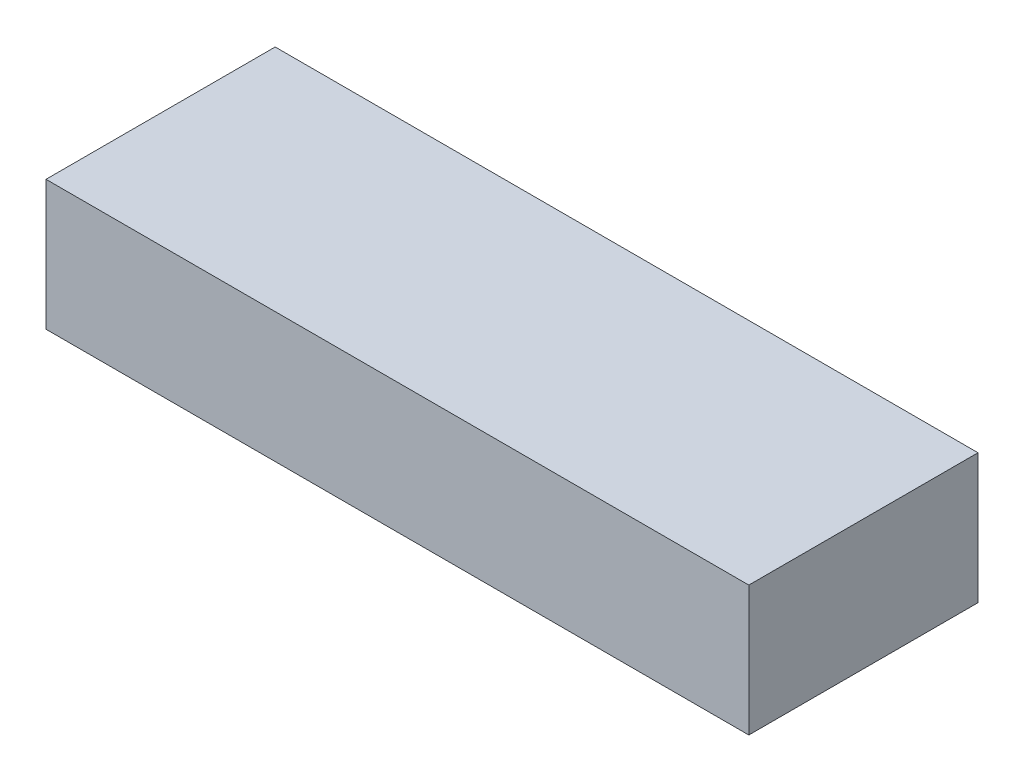
ISO-10303-21;
HEADER;
FILE_DESCRIPTION(('STEP AP214'),'2;1');
FILE_NAME('part.step','',(''),(''),'','','');
FILE_SCHEMA(('AUTOMOTIVE_DESIGN { 1 0 10303 214 1 1 1 1 }'));
ENDSEC;
DATA;
#1=APPLICATION_CONTEXT('core data for automotive mechanical design processes');
#2=APPLICATION_PROTOCOL_DEFINITION('international standard','automotive_design',2000,#1);
#3=PRODUCT_CONTEXT('',#1,'mechanical');
#4=PRODUCT('Part','Part','',(#3));
#5=PRODUCT_RELATED_PRODUCT_CATEGORY('part','',(#4));
#6=PRODUCT_DEFINITION_FORMATION('','',#4);
#7=PRODUCT_DEFINITION_CONTEXT('part definition',#1,'design');
#8=PRODUCT_DEFINITION('design','',#6,#7);
#9=PRODUCT_DEFINITION_SHAPE('','',#8);
#10=(LENGTH_UNIT() NAMED_UNIT(*) SI_UNIT(.MILLI.,.METRE.));
#11=(NAMED_UNIT(*) PLANE_ANGLE_UNIT() SI_UNIT($,.RADIAN.));
#12=(NAMED_UNIT(*) SI_UNIT($,.STERADIAN.) SOLID_ANGLE_UNIT());
#13=UNCERTAINTY_MEASURE_WITH_UNIT(LENGTH_MEASURE(1.E-05),#10,'distance_accuracy_value','');
#14=(GEOMETRIC_REPRESENTATION_CONTEXT(3) GLOBAL_UNCERTAINTY_ASSIGNED_CONTEXT((#13)) GLOBAL_UNIT_ASSIGNED_CONTEXT((#10,
#11,#12)) REPRESENTATION_CONTEXT('',''));
#15=CARTESIAN_POINT('',(0.,0.,0.));
#16=DIRECTION('',(0.,0.,1.));
#17=DIRECTION('',(1.,0.,0.));
#18=AXIS2_PLACEMENT_3D('',#15,#16,#17);
#19=CARTESIAN_POINT('',(23.,8.5,-7.5));
#20=DIRECTION('',(-1.,0.,0.));
#21=DIRECTION('',(0.,0.,1.));
#22=AXIS2_PLACEMENT_3D('',#19,#20,#21);
#23=PLANE('',#22);
#24=DIRECTION('',(0.,0.,-1.));
#25=VECTOR('',#24,1.);
#26=CARTESIAN_POINT('',(23.,0.,-7.5));
#27=LINE('',#26,#25);
#28=CARTESIAN_POINT('',(23.,0.,7.5));
#29=VERTEX_POINT('',#28);
#30=CARTESIAN_POINT('',(23.,0.,-7.5));
#31=VERTEX_POINT('',#30);
#32=EDGE_CURVE('E100',#29,#31,#27,.T.);
#33=ORIENTED_EDGE('',*,*,#32,.T.);
#34=DIRECTION('',(0.,-1.,0.));
#35=VECTOR('',#34,1.);
#36=CARTESIAN_POINT('',(23.,8.5,-7.5));
#37=LINE('',#36,#35);
#38=CARTESIAN_POINT('',(23.,8.5,-7.5));
#39=VERTEX_POINT('',#38);
#40=EDGE_CURVE('E11',#39,#31,#37,.T.);
#41=ORIENTED_EDGE('',*,*,#40,.F.);
#42=DIRECTION('',(0.,0.,-1.));
#43=VECTOR('',#42,1.);
#44=CARTESIAN_POINT('',(23.,8.5,-7.5));
#45=LINE('',#44,#43);
#46=CARTESIAN_POINT('',(23.,8.5,7.5));
#47=VERTEX_POINT('',#46);
#48=EDGE_CURVE('E88',#47,#39,#45,.T.);
#49=ORIENTED_EDGE('',*,*,#48,.F.);
#50=DIRECTION('',(0.,-1.,0.));
#51=VECTOR('',#50,1.);
#52=CARTESIAN_POINT('',(23.,8.5,7.5));
#53=LINE('',#52,#51);
#54=EDGE_CURVE('E96',#47,#29,#53,.T.);
#55=ORIENTED_EDGE('',*,*,#54,.T.);
#56=EDGE_LOOP('',(#33,#41,#49,#55));
#57=FACE_BOUND('',#56,.T.);
#58=ADVANCED_FACE('F37',(#57),#23,.F.);
#59=CARTESIAN_POINT('',(-23.,8.5,-7.5));
#60=DIRECTION('',(0.,0.,1.));
#61=DIRECTION('',(1.,0.,0.));
#62=AXIS2_PLACEMENT_3D('',#59,#60,#61);
#63=PLANE('',#62);
#64=DIRECTION('',(-1.,0.,0.));
#65=VECTOR('',#64,1.);
#66=CARTESIAN_POINT('',(-23.,0.,-7.5));
#67=LINE('',#66,#65);
#68=CARTESIAN_POINT('',(-23.,0.,-7.5));
#69=VERTEX_POINT('',#68);
#70=EDGE_CURVE('E92',#31,#69,#67,.T.);
#71=ORIENTED_EDGE('',*,*,#70,.T.);
#72=DIRECTION('',(0.,-1.,0.));
#73=VECTOR('',#72,1.);
#74=CARTESIAN_POINT('',(-23.,8.5,-7.5));
#75=LINE('',#74,#73);
#76=CARTESIAN_POINT('',(-23.,8.5,-7.5));
#77=VERTEX_POINT('',#76);
#78=EDGE_CURVE('E45',#77,#69,#75,.T.);
#79=ORIENTED_EDGE('',*,*,#78,.F.);
#80=DIRECTION('',(-1.,0.,0.));
#81=VECTOR('',#80,1.);
#82=CARTESIAN_POINT('',(-23.,8.5,-7.5));
#83=LINE('',#82,#81);
#84=EDGE_CURVE('E83',#39,#77,#83,.T.);
#85=ORIENTED_EDGE('',*,*,#84,.F.);
#86=ORIENTED_EDGE('',*,*,#40,.T.);
#87=EDGE_LOOP('',(#71,#79,#85,#86));
#88=FACE_BOUND('',#87,.T.);
#89=ADVANCED_FACE('F91',(#88),#63,.F.);
#90=CARTESIAN_POINT('',(-23.,8.5,-7.5));
#91=DIRECTION('',(1.,0.,0.));
#92=DIRECTION('',(0.,0.,-1.));
#93=AXIS2_PLACEMENT_3D('',#90,#91,#92);
#94=PLANE('',#93);
#95=DIRECTION('',(0.,0.,1.));
#96=VECTOR('',#95,1.);
#97=CARTESIAN_POINT('',(-23.,0.,-7.5));
#98=LINE('',#97,#96);
#99=CARTESIAN_POINT('',(-23.,0.,7.5));
#100=VERTEX_POINT('',#99);
#101=EDGE_CURVE('E70',#69,#100,#98,.T.);
#102=ORIENTED_EDGE('',*,*,#101,.T.);
#103=DIRECTION('',(0.,-1.,0.));
#104=VECTOR('',#103,1.);
#105=CARTESIAN_POINT('',(-23.,8.5,7.5));
#106=LINE('',#105,#104);
#107=CARTESIAN_POINT('',(-23.,8.5,7.5));
#108=VERTEX_POINT('',#107);
#109=EDGE_CURVE('E93',#108,#100,#106,.T.);
#110=ORIENTED_EDGE('',*,*,#109,.F.);
#111=DIRECTION('',(0.,0.,1.));
#112=VECTOR('',#111,1.);
#113=CARTESIAN_POINT('',(-23.,8.5,-7.5));
#114=LINE('',#113,#112);
#115=EDGE_CURVE('E86',#77,#108,#114,.T.);
#116=ORIENTED_EDGE('',*,*,#115,.F.);
#117=ORIENTED_EDGE('',*,*,#78,.T.);
#118=EDGE_LOOP('',(#102,#110,#116,#117));
#119=FACE_BOUND('',#118,.T.);
#120=ADVANCED_FACE('F94',(#119),#94,.F.);
#121=CARTESIAN_POINT('',(-23.,8.5,7.5));
#122=DIRECTION('',(0.,0.,-1.));
#123=DIRECTION('',(-1.,0.,0.));
#124=AXIS2_PLACEMENT_3D('',#121,#122,#123);
#125=PLANE('',#124);
#126=DIRECTION('',(1.,0.,0.));
#127=VECTOR('',#126,1.);
#128=CARTESIAN_POINT('',(-23.,0.,7.5));
#129=LINE('',#128,#127);
#130=EDGE_CURVE('E76',#100,#29,#129,.T.);
#131=ORIENTED_EDGE('',*,*,#130,.T.);
#132=ORIENTED_EDGE('',*,*,#54,.F.);
#133=DIRECTION('',(1.,0.,0.));
#134=VECTOR('',#133,1.);
#135=CARTESIAN_POINT('',(-23.,8.5,7.5));
#136=LINE('',#135,#134);
#137=EDGE_CURVE('E53',#108,#47,#136,.T.);
#138=ORIENTED_EDGE('',*,*,#137,.F.);
#139=ORIENTED_EDGE('',*,*,#109,.T.);
#140=EDGE_LOOP('',(#131,#132,#138,#139));
#141=FACE_BOUND('',#140,.T.);
#142=ADVANCED_FACE('F107',(#141),#125,.F.);
#143=CARTESIAN_POINT('',(0.,8.5,0.));
#144=DIRECTION('',(0.,1.,0.));
#145=DIRECTION('',(0.,0.,1.));
#146=AXIS2_PLACEMENT_3D('',#143,#144,#145);
#147=PLANE('',#146);
#148=ORIENTED_EDGE('',*,*,#48,.T.);
#149=ORIENTED_EDGE('',*,*,#84,.T.);
#150=ORIENTED_EDGE('',*,*,#115,.T.);
#151=ORIENTED_EDGE('',*,*,#137,.T.);
#152=EDGE_LOOP('',(#148,#149,#150,#151));
#153=FACE_BOUND('',#152,.T.);
#154=ADVANCED_FACE('F84',(#153),#147,.T.);
#155=CARTESIAN_POINT('',(0.,0.,0.));
#156=DIRECTION('',(0.,1.,0.));
#157=DIRECTION('',(0.,0.,1.));
#158=AXIS2_PLACEMENT_3D('',#155,#156,#157);
#159=PLANE('',#158);
#160=ORIENTED_EDGE('',*,*,#32,.F.);
#161=ORIENTED_EDGE('',*,*,#130,.F.);
#162=ORIENTED_EDGE('',*,*,#101,.F.);
#163=ORIENTED_EDGE('',*,*,#70,.F.);
#164=EDGE_LOOP('',(#160,#161,#162,#163));
#165=FACE_BOUND('',#164,.T.);
#166=ADVANCED_FACE('F110',(#165),#159,.F.);
#167=CLOSED_SHELL('',(#58,#89,#120,#142,#154,#166));
#168=MANIFOLD_SOLID_BREP('B2',#167);
#169=ADVANCED_BREP_SHAPE_REPRESENTATION('',(#18,#168),#14);
#170=SHAPE_DEFINITION_REPRESENTATION(#9,#169);
ENDSEC;
END-ISO-10303-21;
